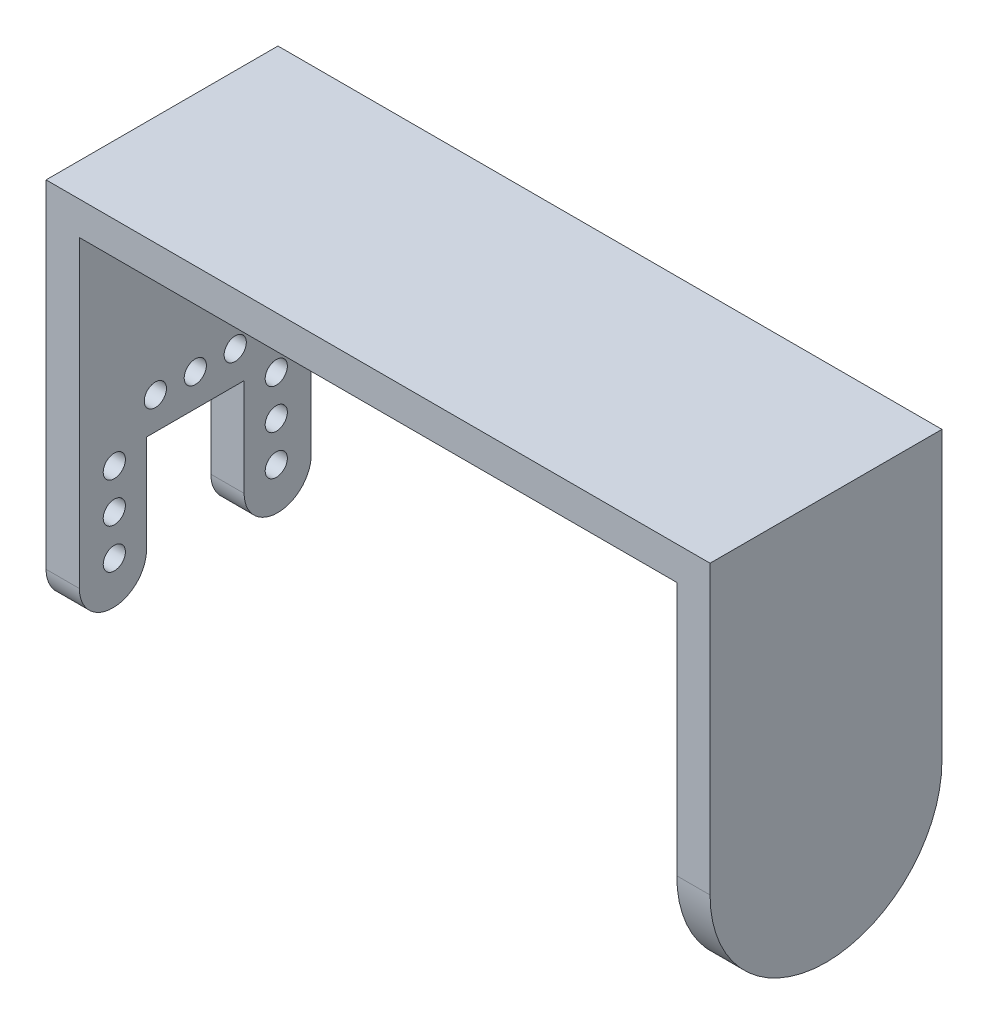
ISO-10303-21;
HEADER;
FILE_DESCRIPTION(('STEP AP214'),'2;1');
FILE_NAME('part.step','',(''),(''),'','','');
FILE_SCHEMA(('AUTOMOTIVE_DESIGN { 1 0 10303 214 1 1 1 1 }'));
ENDSEC;
DATA;
#1=APPLICATION_CONTEXT('core data for automotive mechanical design processes');
#2=APPLICATION_PROTOCOL_DEFINITION('international standard','automotive_design',2000,#1);
#3=PRODUCT_CONTEXT('',#1,'mechanical');
#4=PRODUCT('Part','Part','',(#3));
#5=PRODUCT_RELATED_PRODUCT_CATEGORY('part','',(#4));
#6=PRODUCT_DEFINITION_FORMATION('','',#4);
#7=PRODUCT_DEFINITION_CONTEXT('part definition',#1,'design');
#8=PRODUCT_DEFINITION('design','',#6,#7);
#9=PRODUCT_DEFINITION_SHAPE('','',#8);
#10=(LENGTH_UNIT() NAMED_UNIT(*) SI_UNIT(.MILLI.,.METRE.));
#11=(NAMED_UNIT(*) PLANE_ANGLE_UNIT() SI_UNIT($,.RADIAN.));
#12=(NAMED_UNIT(*) SI_UNIT($,.STERADIAN.) SOLID_ANGLE_UNIT());
#13=UNCERTAINTY_MEASURE_WITH_UNIT(LENGTH_MEASURE(1.E-05),#10,'distance_accuracy_value','');
#14=(GEOMETRIC_REPRESENTATION_CONTEXT(3) GLOBAL_UNCERTAINTY_ASSIGNED_CONTEXT((#13)) GLOBAL_UNIT_ASSIGNED_CONTEXT((#10,
#11,#12)) REPRESENTATION_CONTEXT('',''));
#15=CARTESIAN_POINT('',(0.,0.,0.));
#16=DIRECTION('',(0.,0.,1.));
#17=DIRECTION('',(1.,0.,0.));
#18=AXIS2_PLACEMENT_3D('',#15,#16,#17);
#19=CARTESIAN_POINT('',(0.345806980223205,40.5,67.649975));
#20=DIRECTION('',(1.,0.,0.));
#21=DIRECTION('',(0.,1.,0.));
#22=AXIS2_PLACEMENT_3D('',#19,#20,#21);
#23=PLANE('',#22);
#24=CARTESIAN_POINT('',(0.345806980223204,51.,57.2499750000001));
#25=DIRECTION('',(1.,0.,0.));
#26=DIRECTION('',(0.,1.,0.));
#27=AXIS2_PLACEMENT_3D('',#24,#25,#26);
#28=CIRCLE('',#27,10.5);
#29=CARTESIAN_POINT('',(0.345806980223205,51.,46.7499750000001));
#30=VERTEX_POINT('',#29);
#31=CARTESIAN_POINT('',(0.345806980223206,40.500119048294,57.1999750000001));
#32=VERTEX_POINT('',#31);
#33=EDGE_CURVE('E176',#30,#32,#28,.F.);
#34=ORIENTED_EDGE('',*,*,#33,.T.);
#35=CARTESIAN_POINT('',(0.345806980223204,51.,57.149975));
#36=DIRECTION('',(1.,0.,0.));
#37=DIRECTION('',(0.,1.,0.));
#38=AXIS2_PLACEMENT_3D('',#35,#36,#37);
#39=CIRCLE('',#38,10.5);
#40=CARTESIAN_POINT('',(0.345806980223203,51.,67.649975));
#41=VERTEX_POINT('',#40);
#42=EDGE_CURVE('E135',#32,#41,#39,.F.);
#43=ORIENTED_EDGE('',*,*,#42,.T.);
#44=DIRECTION('',(0.,1.,0.));
#45=VECTOR('',#44,1.);
#46=CARTESIAN_POINT('',(0.345806980223205,40.5,67.649975));
#47=LINE('',#46,#45);
#48=CARTESIAN_POINT('',(0.345806980223197,73.9,67.649975));
#49=VERTEX_POINT('',#48);
#50=EDGE_CURVE('E128',#41,#49,#47,.T.);
#51=ORIENTED_EDGE('',*,*,#50,.T.);
#52=DIRECTION('',(0.,0.,-1.));
#53=VECTOR('',#52,1.);
#54=CARTESIAN_POINT('',(0.345806980223197,73.9,67.649975));
#55=LINE('',#54,#53);
#56=CARTESIAN_POINT('',(0.345806980223198,73.9,46.7499750000001));
#57=VERTEX_POINT('',#56);
#58=EDGE_CURVE('E132',#49,#57,#55,.T.);
#59=ORIENTED_EDGE('',*,*,#58,.T.);
#60=DIRECTION('',(0.,1.,0.));
#61=VECTOR('',#60,1.);
#62=CARTESIAN_POINT('',(0.345806980223208,40.5,46.7499750000001));
#63=LINE('',#62,#61);
#64=EDGE_CURVE('E141',#30,#57,#63,.T.);
#65=ORIENTED_EDGE('',*,*,#64,.F.);
#66=EDGE_LOOP('',(#34,#43,#51,#59,#65));
#67=FACE_BOUND('',#66,.T.);
#68=CARTESIAN_POINT('',(0.345806980223204,50.9,57.199975));
#69=DIRECTION('',(1.,0.,0.));
#70=DIRECTION('',(0.,1.,0.));
#71=AXIS2_PLACEMENT_3D('',#68,#69,#70);
#72=CIRCLE('',#71,2.91);
#73=CARTESIAN_POINT('',(0.345806980223204,53.81,57.199975));
#74=VERTEX_POINT('',#73);
#75=EDGE_CURVE('E186',#74,#74,#72,.F.);
#76=ORIENTED_EDGE('',*,*,#75,.F.);
#77=EDGE_LOOP('',(#76));
#78=FACE_BOUND('',#77,.T.);
#79=ADVANCED_FACE('F34',(#67,#78),#23,.F.);
#80=CARTESIAN_POINT('',(0.,73.9,0.));
#81=DIRECTION('',(0.,1.,0.));
#82=DIRECTION('',(-1.,0.,0.));
#83=AXIS2_PLACEMENT_3D('',#80,#81,#82);
#84=PLANE('',#83);
#85=ORIENTED_EDGE('',*,*,#58,.F.);
#86=DIRECTION('',(1.,0.,0.));
#87=VECTOR('',#86,1.);
#88=CARTESIAN_POINT('',(-56.5041930197768,73.9,67.649975));
#89=LINE('',#88,#87);
#90=CARTESIAN_POINT('',(-53.5041930197768,73.9,67.649975));
#91=VERTEX_POINT('',#90);
#92=EDGE_CURVE('E140',#91,#49,#89,.T.);
#93=ORIENTED_EDGE('',*,*,#92,.F.);
#94=DIRECTION('',(0.,0.,1.));
#95=VECTOR('',#94,1.);
#96=CARTESIAN_POINT('',(-53.5041930197768,73.9,0.));
#97=LINE('',#96,#95);
#98=CARTESIAN_POINT('',(-53.5041930197768,73.9,46.7499750000001));
#99=VERTEX_POINT('',#98);
#100=EDGE_CURVE('E337',#99,#91,#97,.T.);
#101=ORIENTED_EDGE('',*,*,#100,.F.);
#102=DIRECTION('',(-1.,0.,0.));
#103=VECTOR('',#102,1.);
#104=CARTESIAN_POINT('',(-56.5041930197768,73.9,46.7499750000001));
#105=LINE('',#104,#103);
#106=EDGE_CURVE('E147',#57,#99,#105,.T.);
#107=ORIENTED_EDGE('',*,*,#106,.F.);
#108=EDGE_LOOP('',(#85,#93,#101,#107));
#109=FACE_BOUND('',#108,.T.);
#110=ADVANCED_FACE('F144',(#109),#84,.F.);
#111=CARTESIAN_POINT('',(-56.5041930197768,46.5,49.7749750000001));
#112=DIRECTION('',(1.,0.,0.));
#113=DIRECTION('',(0.,1.,0.));
#114=AXIS2_PLACEMENT_3D('',#111,#112,#113);
#115=CYLINDRICAL_SURFACE('',#114,3.02499999999997);
#116=CARTESIAN_POINT('',(-53.5041930197768,46.5,49.7749750000001));
#117=DIRECTION('',(-1.,0.,0.));
#118=DIRECTION('',(0.,0.,1.));
#119=AXIS2_PLACEMENT_3D('',#116,#117,#118);
#120=CIRCLE('',#119,3.02499999999997);
#121=CARTESIAN_POINT('',(-53.5041930197768,46.5,52.7999750000001));
#122=VERTEX_POINT('',#121);
#123=CARTESIAN_POINT('',(-53.5041930197768,46.5,46.7499750000001));
#124=VERTEX_POINT('',#123);
#125=EDGE_CURVE('E309',#122,#124,#120,.F.);
#126=ORIENTED_EDGE('',*,*,#125,.F.);
#127=DIRECTION('',(1.,0.,0.));
#128=VECTOR('',#127,1.);
#129=CARTESIAN_POINT('',(-56.5041930197768,46.5,52.7999750000001));
#130=LINE('',#129,#128);
#131=CARTESIAN_POINT('',(-56.5041930197768,46.5,52.7999750000001));
#132=VERTEX_POINT('',#131);
#133=EDGE_CURVE('E178',#132,#122,#130,.T.);
#134=ORIENTED_EDGE('',*,*,#133,.F.);
#135=CARTESIAN_POINT('',(-56.5041930197768,46.5,49.7749750000001));
#136=DIRECTION('',(-1.,0.,0.));
#137=DIRECTION('',(0.,0.,1.));
#138=AXIS2_PLACEMENT_3D('',#135,#136,#137);
#139=CIRCLE('',#138,3.02499999999997);
#140=CARTESIAN_POINT('',(-56.5041930197768,46.5,46.7499750000001));
#141=VERTEX_POINT('',#140);
#142=EDGE_CURVE('E163',#132,#141,#139,.F.);
#143=ORIENTED_EDGE('',*,*,#142,.T.);
#144=DIRECTION('',(1.,0.,0.));
#145=VECTOR('',#144,1.);
#146=CARTESIAN_POINT('',(-56.5041930197768,46.5,46.7499750000001));
#147=LINE('',#146,#145);
#148=EDGE_CURVE('E371',#141,#124,#147,.T.);
#149=ORIENTED_EDGE('',*,*,#148,.T.);
#150=EDGE_LOOP('',(#126,#134,#143,#149));
#151=FACE_BOUND('',#150,.T.);
#152=ADVANCED_FACE('F208',(#151),#115,.T.);
#153=CARTESIAN_POINT('',(-56.5041930197768,0.,52.7999750000001));
#154=DIRECTION('',(0.,0.,-1.));
#155=DIRECTION('',(-1.,0.,0.));
#156=AXIS2_PLACEMENT_3D('',#153,#154,#155);
#157=PLANE('',#156);
#158=DIRECTION('',(0.,1.,0.));
#159=VECTOR('',#158,1.);
#160=CARTESIAN_POINT('',(-53.5041930197768,0.,52.7999750000001));
#161=LINE('',#160,#159);
#162=CARTESIAN_POINT('',(-53.5041930197768,55.3,52.7999750000001));
#163=VERTEX_POINT('',#162);
#164=EDGE_CURVE('E312',#122,#163,#161,.T.);
#165=ORIENTED_EDGE('',*,*,#164,.T.);
#166=DIRECTION('',(1.,0.,0.));
#167=VECTOR('',#166,1.);
#168=CARTESIAN_POINT('',(-56.5041930197768,55.3,52.7999750000001));
#169=LINE('',#168,#167);
#170=CARTESIAN_POINT('',(-56.5041930197768,55.3,52.7999750000001));
#171=VERTEX_POINT('',#170);
#172=EDGE_CURVE('E379',#171,#163,#169,.T.);
#173=ORIENTED_EDGE('',*,*,#172,.F.);
#174=DIRECTION('',(0.,1.,0.));
#175=VECTOR('',#174,1.);
#176=CARTESIAN_POINT('',(-56.5041930197768,0.,52.7999750000001));
#177=LINE('',#176,#175);
#178=EDGE_CURVE('E383',#132,#171,#177,.T.);
#179=ORIENTED_EDGE('',*,*,#178,.F.);
#180=ORIENTED_EDGE('',*,*,#133,.T.);
#181=EDGE_LOOP('',(#165,#173,#179,#180));
#182=FACE_BOUND('',#181,.T.);
#183=ADVANCED_FACE('F281',(#182),#157,.F.);
#184=CARTESIAN_POINT('',(-56.5041930197768,55.3,0.));
#185=DIRECTION('',(0.,-1.,0.));
#186=DIRECTION('',(1.,0.,0.));
#187=AXIS2_PLACEMENT_3D('',#184,#185,#186);
#188=PLANE('',#187);
#189=DIRECTION('',(0.,0.,-1.));
#190=VECTOR('',#189,1.);
#191=CARTESIAN_POINT('',(-53.5041930197768,55.3,0.));
#192=LINE('',#191,#190);
#193=CARTESIAN_POINT('',(-53.5041930197768,55.3,61.5999750000001));
#194=VERTEX_POINT('',#193);
#195=EDGE_CURVE('E319',#194,#163,#192,.T.);
#196=ORIENTED_EDGE('',*,*,#195,.F.);
#197=DIRECTION('',(1.,0.,0.));
#198=VECTOR('',#197,1.);
#199=CARTESIAN_POINT('',(-56.5041930197768,55.3,61.5999750000001));
#200=LINE('',#199,#198);
#201=CARTESIAN_POINT('',(-56.5041930197768,55.3,61.5999750000001));
#202=VERTEX_POINT('',#201);
#203=EDGE_CURVE('E377',#202,#194,#200,.T.);
#204=ORIENTED_EDGE('',*,*,#203,.F.);
#205=DIRECTION('',(0.,0.,-1.));
#206=VECTOR('',#205,1.);
#207=CARTESIAN_POINT('',(-56.5041930197768,55.3,0.));
#208=LINE('',#207,#206);
#209=EDGE_CURVE('E399',#202,#171,#208,.T.);
#210=ORIENTED_EDGE('',*,*,#209,.T.);
#211=ORIENTED_EDGE('',*,*,#172,.T.);
#212=EDGE_LOOP('',(#196,#204,#210,#211));
#213=FACE_BOUND('',#212,.T.);
#214=ADVANCED_FACE('F277',(#213),#188,.T.);
#215=CARTESIAN_POINT('',(-56.5041930197768,0.,61.5999750000001));
#216=DIRECTION('',(0.,0.,-1.));
#217=DIRECTION('',(-1.,0.,0.));
#218=AXIS2_PLACEMENT_3D('',#215,#216,#217);
#219=PLANE('',#218);
#220=DIRECTION('',(0.,1.,0.));
#221=VECTOR('',#220,1.);
#222=CARTESIAN_POINT('',(-53.5041930197768,0.,61.5999750000001));
#223=LINE('',#222,#221);
#224=CARTESIAN_POINT('',(-53.5041930197768,46.5,61.5999750000001));
#225=VERTEX_POINT('',#224);
#226=EDGE_CURVE('E327',#225,#194,#223,.T.);
#227=ORIENTED_EDGE('',*,*,#226,.F.);
#228=DIRECTION('',(1.,0.,0.));
#229=VECTOR('',#228,1.);
#230=CARTESIAN_POINT('',(-56.5041930197768,46.5,61.5999750000001));
#231=LINE('',#230,#229);
#232=CARTESIAN_POINT('',(-56.5041930197768,46.5,61.5999750000001));
#233=VERTEX_POINT('',#232);
#234=EDGE_CURVE('E375',#233,#225,#231,.T.);
#235=ORIENTED_EDGE('',*,*,#234,.F.);
#236=DIRECTION('',(0.,1.,0.));
#237=VECTOR('',#236,1.);
#238=CARTESIAN_POINT('',(-56.5041930197768,0.,61.5999750000001));
#239=LINE('',#238,#237);
#240=EDGE_CURVE('E396',#233,#202,#239,.T.);
#241=ORIENTED_EDGE('',*,*,#240,.T.);
#242=ORIENTED_EDGE('',*,*,#203,.T.);
#243=EDGE_LOOP('',(#227,#235,#241,#242));
#244=FACE_BOUND('',#243,.T.);
#245=ADVANCED_FACE('F273',(#244),#219,.T.);
#246=CARTESIAN_POINT('',(-56.5041930197768,46.5,64.624975));
#247=DIRECTION('',(1.,0.,0.));
#248=DIRECTION('',(0.,1.,0.));
#249=AXIS2_PLACEMENT_3D('',#246,#247,#248);
#250=CYLINDRICAL_SURFACE('',#249,3.02499999999999);
#251=CARTESIAN_POINT('',(-53.5041930197768,46.5,64.624975));
#252=DIRECTION('',(-1.,0.,0.));
#253=DIRECTION('',(0.,0.,1.));
#254=AXIS2_PLACEMENT_3D('',#251,#252,#253);
#255=CIRCLE('',#254,3.02499999999999);
#256=CARTESIAN_POINT('',(-53.5041930197768,46.5,67.649975));
#257=VERTEX_POINT('',#256);
#258=EDGE_CURVE('E330',#225,#257,#255,.T.);
#259=ORIENTED_EDGE('',*,*,#258,.T.);
#260=DIRECTION('',(1.,0.,0.));
#261=VECTOR('',#260,1.);
#262=CARTESIAN_POINT('',(-56.5041930197768,46.5,67.649975));
#263=LINE('',#262,#261);
#264=CARTESIAN_POINT('',(-56.5041930197768,46.5,67.649975));
#265=VERTEX_POINT('',#264);
#266=EDGE_CURVE('E373',#265,#257,#263,.T.);
#267=ORIENTED_EDGE('',*,*,#266,.F.);
#268=CARTESIAN_POINT('',(-56.5041930197768,46.5,64.624975));
#269=DIRECTION('',(-1.,0.,0.));
#270=DIRECTION('',(0.,0.,1.));
#271=AXIS2_PLACEMENT_3D('',#268,#269,#270);
#272=CIRCLE('',#271,3.02499999999999);
#273=EDGE_CURVE('E401',#233,#265,#272,.T.);
#274=ORIENTED_EDGE('',*,*,#273,.F.);
#275=ORIENTED_EDGE('',*,*,#234,.T.);
#276=EDGE_LOOP('',(#259,#267,#274,#275));
#277=FACE_BOUND('',#276,.T.);
#278=ADVANCED_FACE('F270',(#277),#250,.T.);
#279=CARTESIAN_POINT('',(-56.5041930197768,0.,67.649975));
#280=DIRECTION('',(0.,0.,-1.));
#281=DIRECTION('',(-1.,0.,0.));
#282=AXIS2_PLACEMENT_3D('',#279,#280,#281);
#283=PLANE('',#282);
#284=ORIENTED_EDGE('',*,*,#50,.F.);
#285=DIRECTION('',(-1.,0.,0.));
#286=VECTOR('',#285,1.);
#287=CARTESIAN_POINT('',(-56.5041930197768,51.,67.649975));
#288=LINE('',#287,#286);
#289=CARTESIAN_POINT('',(3.3458069802232,51.,67.649975));
#290=VERTEX_POINT('',#289);
#291=EDGE_CURVE('E180',#41,#290,#288,.F.);
#292=ORIENTED_EDGE('',*,*,#291,.T.);
#293=DIRECTION('',(0.,-1.,0.));
#294=VECTOR('',#293,1.);
#295=CARTESIAN_POINT('',(3.3458069802232,76.9,67.649975));
#296=LINE('',#295,#294);
#297=CARTESIAN_POINT('',(3.3458069802232,76.9,67.649975));
#298=VERTEX_POINT('',#297);
#299=EDGE_CURVE('E161',#298,#290,#296,.T.);
#300=ORIENTED_EDGE('',*,*,#299,.F.);
#301=DIRECTION('',(1.,0.,0.));
#302=VECTOR('',#301,1.);
#303=CARTESIAN_POINT('',(-56.5041930197768,76.9,67.649975));
#304=LINE('',#303,#302);
#305=CARTESIAN_POINT('',(-56.5041930197768,76.9,67.649975));
#306=VERTEX_POINT('',#305);
#307=EDGE_CURVE('E304',#306,#298,#304,.T.);
#308=ORIENTED_EDGE('',*,*,#307,.F.);
#309=DIRECTION('',(0.,1.,0.));
#310=VECTOR('',#309,1.);
#311=CARTESIAN_POINT('',(-56.5041930197768,0.,67.649975));
#312=LINE('',#311,#310);
#313=EDGE_CURVE('E405',#265,#306,#312,.T.);
#314=ORIENTED_EDGE('',*,*,#313,.F.);
#315=ORIENTED_EDGE('',*,*,#266,.T.);
#316=DIRECTION('',(0.,1.,0.));
#317=VECTOR('',#316,1.);
#318=CARTESIAN_POINT('',(-53.5041930197768,0.,67.649975));
#319=LINE('',#318,#317);
#320=EDGE_CURVE('E153',#257,#91,#319,.T.);
#321=ORIENTED_EDGE('',*,*,#320,.T.);
#322=ORIENTED_EDGE('',*,*,#92,.T.);
#323=EDGE_LOOP('',(#284,#292,#300,#308,#314,#315,#321,#322));
#324=FACE_BOUND('',#323,.T.);
#325=ADVANCED_FACE('F150',(#324),#283,.F.);
#326=CARTESIAN_POINT('',(-56.5041930197768,50.8999999999998,49.8999749999999));
#327=DIRECTION('',(1.,0.,0.));
#328=DIRECTION('',(0.,1.,0.));
#329=AXIS2_PLACEMENT_3D('',#326,#327,#328);
#330=CYLINDRICAL_SURFACE('',#329,1.);
#331=CARTESIAN_POINT('',(-56.5041930197768,50.8999999999998,49.8999749999999));
#332=DIRECTION('',(-1.,0.,0.));
#333=DIRECTION('',(0.,0.,1.));
#334=AXIS2_PLACEMENT_3D('',#331,#332,#333);
#335=CIRCLE('',#334,1.);
#336=CARTESIAN_POINT('',(-56.5041930197768,50.8999999999998,50.8999749999999));
#337=VERTEX_POINT('',#336);
#338=EDGE_CURVE('E428',#337,#337,#335,.F.);
#339=ORIENTED_EDGE('',*,*,#338,.F.);
#340=EDGE_LOOP('',(#339));
#341=FACE_BOUND('',#340,.T.);
#342=CARTESIAN_POINT('',(-53.5041930197768,50.8999999999998,49.8999749999999));
#343=DIRECTION('',(-1.,0.,0.));
#344=DIRECTION('',(0.,0.,1.));
#345=AXIS2_PLACEMENT_3D('',#342,#343,#344);
#346=CIRCLE('',#345,1.);
#347=CARTESIAN_POINT('',(-53.5041930197768,50.8999999999998,50.8999749999999));
#348=VERTEX_POINT('',#347);
#349=EDGE_CURVE('E365',#348,#348,#346,.F.);
#350=ORIENTED_EDGE('',*,*,#349,.T.);
#351=EDGE_LOOP('',(#350));
#352=FACE_BOUND('',#351,.T.);
#353=ADVANCED_FACE('F233',(#341,#352),#330,.F.);
#354=CARTESIAN_POINT('',(-56.5041930197768,58.2,60.7999749999998));
#355=DIRECTION('',(1.,0.,0.));
#356=DIRECTION('',(0.,1.,0.));
#357=AXIS2_PLACEMENT_3D('',#354,#355,#356);
#358=CYLINDRICAL_SURFACE('',#357,0.999999999999997);
#359=CARTESIAN_POINT('',(-56.5041930197768,58.2,60.7999749999998));
#360=DIRECTION('',(-1.,0.,0.));
#361=DIRECTION('',(0.,0.,1.));
#362=AXIS2_PLACEMENT_3D('',#359,#360,#361);
#363=CIRCLE('',#362,0.999999999999997);
#364=CARTESIAN_POINT('',(-56.5041930197768,58.2,61.7999749999998));
#365=VERTEX_POINT('',#364);
#366=EDGE_CURVE('E426',#365,#365,#363,.F.);
#367=ORIENTED_EDGE('',*,*,#366,.F.);
#368=EDGE_LOOP('',(#367));
#369=FACE_BOUND('',#368,.T.);
#370=CARTESIAN_POINT('',(-53.5041930197768,58.2,60.7999749999998));
#371=DIRECTION('',(-1.,0.,0.));
#372=DIRECTION('',(0.,0.,1.));
#373=AXIS2_PLACEMENT_3D('',#370,#371,#372);
#374=CIRCLE('',#373,0.999999999999997);
#375=CARTESIAN_POINT('',(-53.5041930197768,58.2,61.7999749999998));
#376=VERTEX_POINT('',#375);
#377=EDGE_CURVE('E362',#376,#376,#374,.F.);
#378=ORIENTED_EDGE('',*,*,#377,.T.);
#379=EDGE_LOOP('',(#378));
#380=FACE_BOUND('',#379,.T.);
#381=ADVANCED_FACE('F236',(#369,#380),#358,.F.);
#382=CARTESIAN_POINT('',(-56.5041930197768,54.5000000000001,64.4999749999999));
#383=DIRECTION('',(1.,0.,0.));
#384=DIRECTION('',(0.,1.,0.));
#385=AXIS2_PLACEMENT_3D('',#382,#383,#384);
#386=CYLINDRICAL_SURFACE('',#385,0.999999999999999);
#387=CARTESIAN_POINT('',(-56.5041930197768,54.5000000000001,64.4999749999999));
#388=DIRECTION('',(-1.,0.,0.));
#389=DIRECTION('',(0.,0.,1.));
#390=AXIS2_PLACEMENT_3D('',#387,#388,#389);
#391=CIRCLE('',#390,0.999999999999999);
#392=CARTESIAN_POINT('',(-56.5041930197768,54.5000000000001,65.4999749999999));
#393=VERTEX_POINT('',#392);
#394=EDGE_CURVE('E423',#393,#393,#391,.F.);
#395=ORIENTED_EDGE('',*,*,#394,.F.);
#396=EDGE_LOOP('',(#395));
#397=FACE_BOUND('',#396,.T.);
#398=CARTESIAN_POINT('',(-53.5041930197768,54.5000000000001,64.4999749999999));
#399=DIRECTION('',(-1.,0.,0.));
#400=DIRECTION('',(0.,0.,1.));
#401=AXIS2_PLACEMENT_3D('',#398,#399,#400);
#402=CIRCLE('',#401,0.999999999999999);
#403=CARTESIAN_POINT('',(-53.5041930197768,54.5000000000001,65.4999749999999));
#404=VERTEX_POINT('',#403);
#405=EDGE_CURVE('E359',#404,#404,#402,.F.);
#406=ORIENTED_EDGE('',*,*,#405,.T.);
#407=EDGE_LOOP('',(#406));
#408=FACE_BOUND('',#407,.T.);
#409=ADVANCED_FACE('F240',(#397,#408),#386,.F.);
#410=CARTESIAN_POINT('',(-56.5041930197768,50.9000000000001,64.4999749999999));
#411=DIRECTION('',(1.,0.,0.));
#412=DIRECTION('',(0.,1.,0.));
#413=AXIS2_PLACEMENT_3D('',#410,#411,#412);
#414=CYLINDRICAL_SURFACE('',#413,1.);
#415=CARTESIAN_POINT('',(-56.5041930197768,50.9000000000001,64.4999749999999));
#416=DIRECTION('',(-1.,0.,0.));
#417=DIRECTION('',(0.,0.,1.));
#418=AXIS2_PLACEMENT_3D('',#415,#416,#417);
#419=CIRCLE('',#418,1.);
#420=CARTESIAN_POINT('',(-56.5041930197768,50.9000000000001,65.4999749999999));
#421=VERTEX_POINT('',#420);
#422=EDGE_CURVE('E420',#421,#421,#419,.F.);
#423=ORIENTED_EDGE('',*,*,#422,.F.);
#424=EDGE_LOOP('',(#423));
#425=FACE_BOUND('',#424,.T.);
#426=CARTESIAN_POINT('',(-53.5041930197768,50.9000000000001,64.4999749999999));
#427=DIRECTION('',(-1.,0.,0.));
#428=DIRECTION('',(0.,0.,1.));
#429=AXIS2_PLACEMENT_3D('',#426,#427,#428);
#430=CIRCLE('',#429,1.);
#431=CARTESIAN_POINT('',(-53.5041930197768,50.9000000000001,65.4999749999999));
#432=VERTEX_POINT('',#431);
#433=EDGE_CURVE('E356',#432,#432,#430,.F.);
#434=ORIENTED_EDGE('',*,*,#433,.T.);
#435=EDGE_LOOP('',(#434));
#436=FACE_BOUND('',#435,.T.);
#437=ADVANCED_FACE('F244',(#425,#436),#414,.F.);
#438=CARTESIAN_POINT('',(-56.5041930197768,47.3000000000001,64.4999749999999));
#439=DIRECTION('',(1.,0.,0.));
#440=DIRECTION('',(0.,1.,0.));
#441=AXIS2_PLACEMENT_3D('',#438,#439,#440);
#442=CYLINDRICAL_SURFACE('',#441,0.999999999999999);
#443=CARTESIAN_POINT('',(-56.5041930197768,47.3000000000001,64.4999749999999));
#444=DIRECTION('',(-1.,0.,0.));
#445=DIRECTION('',(0.,0.,1.));
#446=AXIS2_PLACEMENT_3D('',#443,#444,#445);
#447=CIRCLE('',#446,0.999999999999999);
#448=CARTESIAN_POINT('',(-56.5041930197768,47.3000000000001,65.4999749999999));
#449=VERTEX_POINT('',#448);
#450=EDGE_CURVE('E417',#449,#449,#447,.F.);
#451=ORIENTED_EDGE('',*,*,#450,.F.);
#452=EDGE_LOOP('',(#451));
#453=FACE_BOUND('',#452,.T.);
#454=CARTESIAN_POINT('',(-53.5041930197768,47.3000000000001,64.4999749999999));
#455=DIRECTION('',(-1.,0.,0.));
#456=DIRECTION('',(0.,0.,1.));
#457=AXIS2_PLACEMENT_3D('',#454,#455,#456);
#458=CIRCLE('',#457,0.999999999999999);
#459=CARTESIAN_POINT('',(-53.5041930197768,47.3000000000001,65.4999749999999));
#460=VERTEX_POINT('',#459);
#461=EDGE_CURVE('E351',#460,#460,#458,.F.);
#462=ORIENTED_EDGE('',*,*,#461,.T.);
#463=EDGE_LOOP('',(#462));
#464=FACE_BOUND('',#463,.T.);
#465=ADVANCED_FACE('F248',(#453,#464),#442,.F.);
#466=CARTESIAN_POINT('',(-56.5041930197768,58.2,57.1999749999998));
#467=DIRECTION('',(1.,0.,0.));
#468=DIRECTION('',(0.,1.,0.));
#469=AXIS2_PLACEMENT_3D('',#466,#467,#468);
#470=CYLINDRICAL_SURFACE('',#469,0.999999999999998);
#471=CARTESIAN_POINT('',(-56.5041930197768,58.2,57.1999749999998));
#472=DIRECTION('',(-1.,0.,0.));
#473=DIRECTION('',(0.,0.,1.));
#474=AXIS2_PLACEMENT_3D('',#471,#472,#473);
#475=CIRCLE('',#474,0.999999999999998);
#476=CARTESIAN_POINT('',(-56.5041930197768,58.2,58.1999749999998));
#477=VERTEX_POINT('',#476);
#478=EDGE_CURVE('E414',#477,#477,#475,.F.);
#479=ORIENTED_EDGE('',*,*,#478,.F.);
#480=EDGE_LOOP('',(#479));
#481=FACE_BOUND('',#480,.T.);
#482=CARTESIAN_POINT('',(-53.5041930197768,58.2,57.1999749999998));
#483=DIRECTION('',(-1.,0.,0.));
#484=DIRECTION('',(0.,0.,1.));
#485=AXIS2_PLACEMENT_3D('',#482,#483,#484);
#486=CIRCLE('',#485,0.999999999999998);
#487=CARTESIAN_POINT('',(-53.5041930197768,58.2,58.1999749999998));
#488=VERTEX_POINT('',#487);
#489=EDGE_CURVE('E347',#488,#488,#486,.F.);
#490=ORIENTED_EDGE('',*,*,#489,.T.);
#491=EDGE_LOOP('',(#490));
#492=FACE_BOUND('',#491,.T.);
#493=ADVANCED_FACE('F252',(#481,#492),#470,.F.);
#494=CARTESIAN_POINT('',(-56.5041930197768,58.1999999999999,53.5999749999998));
#495=DIRECTION('',(1.,0.,0.));
#496=DIRECTION('',(0.,1.,0.));
#497=AXIS2_PLACEMENT_3D('',#494,#495,#496);
#498=CYLINDRICAL_SURFACE('',#497,1.);
#499=CARTESIAN_POINT('',(-56.5041930197768,58.1999999999999,53.5999749999998));
#500=DIRECTION('',(-1.,0.,0.));
#501=DIRECTION('',(0.,0.,1.));
#502=AXIS2_PLACEMENT_3D('',#499,#500,#501);
#503=CIRCLE('',#502,1.);
#504=CARTESIAN_POINT('',(-56.5041930197768,58.1999999999999,54.5999749999998));
#505=VERTEX_POINT('',#504);
#506=EDGE_CURVE('E411',#505,#505,#503,.F.);
#507=ORIENTED_EDGE('',*,*,#506,.F.);
#508=EDGE_LOOP('',(#507));
#509=FACE_BOUND('',#508,.T.);
#510=CARTESIAN_POINT('',(-53.5041930197768,58.1999999999999,53.5999749999998));
#511=DIRECTION('',(-1.,0.,0.));
#512=DIRECTION('',(0.,0.,1.));
#513=AXIS2_PLACEMENT_3D('',#510,#511,#512);
#514=CIRCLE('',#513,1.);
#515=CARTESIAN_POINT('',(-53.5041930197768,58.1999999999999,54.5999749999998));
#516=VERTEX_POINT('',#515);
#517=EDGE_CURVE('E343',#516,#516,#514,.F.);
#518=ORIENTED_EDGE('',*,*,#517,.T.);
#519=EDGE_LOOP('',(#518));
#520=FACE_BOUND('',#519,.T.);
#521=ADVANCED_FACE('F256',(#509,#520),#498,.F.);
#522=CARTESIAN_POINT('',(-56.5041930197768,54.4999999999998,49.8999749999999));
#523=DIRECTION('',(1.,0.,0.));
#524=DIRECTION('',(0.,1.,0.));
#525=AXIS2_PLACEMENT_3D('',#522,#523,#524);
#526=CYLINDRICAL_SURFACE('',#525,0.999999999999998);
#527=CARTESIAN_POINT('',(-56.5041930197768,54.4999999999998,49.8999749999999));
#528=DIRECTION('',(-1.,0.,0.));
#529=DIRECTION('',(0.,0.,1.));
#530=AXIS2_PLACEMENT_3D('',#527,#528,#529);
#531=CIRCLE('',#530,0.999999999999998);
#532=CARTESIAN_POINT('',(-56.5041930197768,54.4999999999998,50.8999749999999));
#533=VERTEX_POINT('',#532);
#534=EDGE_CURVE('E408',#533,#533,#531,.F.);
#535=ORIENTED_EDGE('',*,*,#534,.F.);
#536=EDGE_LOOP('',(#535));
#537=FACE_BOUND('',#536,.T.);
#538=CARTESIAN_POINT('',(-53.5041930197768,54.4999999999998,49.8999749999999));
#539=DIRECTION('',(-1.,0.,0.));
#540=DIRECTION('',(0.,0.,1.));
#541=AXIS2_PLACEMENT_3D('',#538,#539,#540);
#542=CIRCLE('',#541,0.999999999999998);
#543=CARTESIAN_POINT('',(-53.5041930197768,54.4999999999998,50.8999749999999));
#544=VERTEX_POINT('',#543);
#545=EDGE_CURVE('E334',#544,#544,#542,.F.);
#546=ORIENTED_EDGE('',*,*,#545,.T.);
#547=EDGE_LOOP('',(#546));
#548=FACE_BOUND('',#547,.T.);
#549=ADVANCED_FACE('F260',(#537,#548),#526,.F.);
#550=CARTESIAN_POINT('',(-56.5041930197768,0.,46.7499750000001));
#551=DIRECTION('',(0.,0.,-1.));
#552=DIRECTION('',(-1.,0.,0.));
#553=AXIS2_PLACEMENT_3D('',#550,#551,#552);
#554=PLANE('',#553);
#555=DIRECTION('',(0.,-1.,0.));
#556=VECTOR('',#555,1.);
#557=CARTESIAN_POINT('',(3.3458069802232,76.9,46.7499750000001));
#558=LINE('',#557,#556);
#559=CARTESIAN_POINT('',(3.3458069802232,76.9,46.7499750000001));
#560=VERTEX_POINT('',#559);
#561=CARTESIAN_POINT('',(3.3458069802232,51.,46.7499750000001));
#562=VERTEX_POINT('',#561);
#563=EDGE_CURVE('E171',#560,#562,#558,.T.);
#564=ORIENTED_EDGE('',*,*,#563,.T.);
#565=DIRECTION('',(1.,0.,0.));
#566=VECTOR('',#565,1.);
#567=CARTESIAN_POINT('',(0.345806980223208,51.,46.7499750000001));
#568=LINE('',#567,#566);
#569=EDGE_CURVE('E184',#562,#30,#568,.F.);
#570=ORIENTED_EDGE('',*,*,#569,.T.);
#571=ORIENTED_EDGE('',*,*,#64,.T.);
#572=ORIENTED_EDGE('',*,*,#106,.T.);
#573=DIRECTION('',(0.,1.,0.));
#574=VECTOR('',#573,1.);
#575=CARTESIAN_POINT('',(-53.5041930197768,0.,46.7499750000001));
#576=LINE('',#575,#574);
#577=EDGE_CURVE('E339',#124,#99,#576,.T.);
#578=ORIENTED_EDGE('',*,*,#577,.F.);
#579=ORIENTED_EDGE('',*,*,#148,.F.);
#580=DIRECTION('',(0.,1.,0.));
#581=VECTOR('',#580,1.);
#582=CARTESIAN_POINT('',(-56.5041930197768,0.,46.7499750000001));
#583=LINE('',#582,#581);
#584=CARTESIAN_POINT('',(-56.5041930197768,76.9,46.7499750000001));
#585=VERTEX_POINT('',#584);
#586=EDGE_CURVE('E389',#141,#585,#583,.T.);
#587=ORIENTED_EDGE('',*,*,#586,.T.);
#588=DIRECTION('',(-1.,0.,0.));
#589=VECTOR('',#588,1.);
#590=CARTESIAN_POINT('',(-56.5041930197768,76.9,46.7499750000001));
#591=LINE('',#590,#589);
#592=EDGE_CURVE('E168',#560,#585,#591,.T.);
#593=ORIENTED_EDGE('',*,*,#592,.F.);
#594=EDGE_LOOP('',(#564,#570,#571,#572,#578,#579,#587,#593));
#595=FACE_BOUND('',#594,.T.);
#596=ADVANCED_FACE('F231',(#595),#554,.T.);
#597=CARTESIAN_POINT('',(-56.5041930197768,47.2999999999998,49.899975));
#598=DIRECTION('',(1.,0.,0.));
#599=DIRECTION('',(0.,1.,0.));
#600=AXIS2_PLACEMENT_3D('',#597,#598,#599);
#601=CYLINDRICAL_SURFACE('',#600,1.);
#602=CARTESIAN_POINT('',(-56.5041930197768,47.2999999999998,49.899975));
#603=DIRECTION('',(-1.,0.,0.));
#604=DIRECTION('',(0.,0.,1.));
#605=AXIS2_PLACEMENT_3D('',#602,#603,#604);
#606=CIRCLE('',#605,1.);
#607=CARTESIAN_POINT('',(-56.5041930197768,47.2999999999998,50.899975));
#608=VERTEX_POINT('',#607);
#609=EDGE_CURVE('E322',#608,#608,#606,.F.);
#610=ORIENTED_EDGE('',*,*,#609,.F.);
#611=EDGE_LOOP('',(#610));
#612=FACE_BOUND('',#611,.T.);
#613=CARTESIAN_POINT('',(-53.5041930197768,47.2999999999998,49.899975));
#614=DIRECTION('',(-1.,0.,0.));
#615=DIRECTION('',(0.,0.,1.));
#616=AXIS2_PLACEMENT_3D('',#613,#614,#615);
#617=CIRCLE('',#616,1.);
#618=CARTESIAN_POINT('',(-53.5041930197768,47.2999999999998,50.899975));
#619=VERTEX_POINT('',#618);
#620=EDGE_CURVE('E368',#619,#619,#617,.F.);
#621=ORIENTED_EDGE('',*,*,#620,.T.);
#622=EDGE_LOOP('',(#621));
#623=FACE_BOUND('',#622,.T.);
#624=ADVANCED_FACE('F224',(#612,#623),#601,.F.);
#625=CARTESIAN_POINT('',(-56.5041930197768,0.,0.));
#626=DIRECTION('',(-1.,0.,0.));
#627=DIRECTION('',(0.,0.,1.));
#628=AXIS2_PLACEMENT_3D('',#625,#626,#627);
#629=PLANE('',#628);
#630=ORIENTED_EDGE('',*,*,#142,.F.);
#631=ORIENTED_EDGE('',*,*,#178,.T.);
#632=ORIENTED_EDGE('',*,*,#209,.F.);
#633=ORIENTED_EDGE('',*,*,#240,.F.);
#634=ORIENTED_EDGE('',*,*,#273,.T.);
#635=ORIENTED_EDGE('',*,*,#313,.T.);
#636=DIRECTION('',(0.,0.,1.));
#637=VECTOR('',#636,1.);
#638=CARTESIAN_POINT('',(-56.5041930197768,76.9,46.7499750000001));
#639=LINE('',#638,#637);
#640=EDGE_CURVE('E156',#585,#306,#639,.T.);
#641=ORIENTED_EDGE('',*,*,#640,.F.);
#642=ORIENTED_EDGE('',*,*,#586,.F.);
#643=EDGE_LOOP('',(#630,#631,#632,#633,#634,#635,#641,#642));
#644=FACE_BOUND('',#643,.T.);
#645=ORIENTED_EDGE('',*,*,#534,.T.);
#646=EDGE_LOOP('',(#645));
#647=FACE_BOUND('',#646,.T.);
#648=ORIENTED_EDGE('',*,*,#506,.T.);
#649=EDGE_LOOP('',(#648));
#650=FACE_BOUND('',#649,.T.);
#651=ORIENTED_EDGE('',*,*,#478,.T.);
#652=EDGE_LOOP('',(#651));
#653=FACE_BOUND('',#652,.T.);
#654=ORIENTED_EDGE('',*,*,#450,.T.);
#655=EDGE_LOOP('',(#654));
#656=FACE_BOUND('',#655,.T.);
#657=ORIENTED_EDGE('',*,*,#422,.T.);
#658=EDGE_LOOP('',(#657));
#659=FACE_BOUND('',#658,.T.);
#660=ORIENTED_EDGE('',*,*,#394,.T.);
#661=EDGE_LOOP('',(#660));
#662=FACE_BOUND('',#661,.T.);
#663=ORIENTED_EDGE('',*,*,#366,.T.);
#664=EDGE_LOOP('',(#663));
#665=FACE_BOUND('',#664,.T.);
#666=ORIENTED_EDGE('',*,*,#338,.T.);
#667=EDGE_LOOP('',(#666));
#668=FACE_BOUND('',#667,.T.);
#669=ORIENTED_EDGE('',*,*,#609,.T.);
#670=EDGE_LOOP('',(#669));
#671=FACE_BOUND('',#670,.T.);
#672=ADVANCED_FACE('F221',(#644,#647,#650,#653,#656,#659,#662,#665,#668,#671),#629,.T.);
#673=CARTESIAN_POINT('',(-53.5041930197768,0.,0.));
#674=DIRECTION('',(-1.,0.,0.));
#675=DIRECTION('',(0.,0.,1.));
#676=AXIS2_PLACEMENT_3D('',#673,#674,#675);
#677=PLANE('',#676);
#678=ORIENTED_EDGE('',*,*,#125,.T.);
#679=ORIENTED_EDGE('',*,*,#577,.T.);
#680=ORIENTED_EDGE('',*,*,#100,.T.);
#681=ORIENTED_EDGE('',*,*,#320,.F.);
#682=ORIENTED_EDGE('',*,*,#258,.F.);
#683=ORIENTED_EDGE('',*,*,#226,.T.);
#684=ORIENTED_EDGE('',*,*,#195,.T.);
#685=ORIENTED_EDGE('',*,*,#164,.F.);
#686=EDGE_LOOP('',(#678,#679,#680,#681,#682,#683,#684,#685));
#687=FACE_BOUND('',#686,.T.);
#688=ORIENTED_EDGE('',*,*,#545,.F.);
#689=EDGE_LOOP('',(#688));
#690=FACE_BOUND('',#689,.T.);
#691=ORIENTED_EDGE('',*,*,#517,.F.);
#692=EDGE_LOOP('',(#691));
#693=FACE_BOUND('',#692,.T.);
#694=ORIENTED_EDGE('',*,*,#489,.F.);
#695=EDGE_LOOP('',(#694));
#696=FACE_BOUND('',#695,.T.);
#697=ORIENTED_EDGE('',*,*,#461,.F.);
#698=EDGE_LOOP('',(#697));
#699=FACE_BOUND('',#698,.T.);
#700=ORIENTED_EDGE('',*,*,#433,.F.);
#701=EDGE_LOOP('',(#700));
#702=FACE_BOUND('',#701,.T.);
#703=ORIENTED_EDGE('',*,*,#405,.F.);
#704=EDGE_LOOP('',(#703));
#705=FACE_BOUND('',#704,.T.);
#706=ORIENTED_EDGE('',*,*,#377,.F.);
#707=EDGE_LOOP('',(#706));
#708=FACE_BOUND('',#707,.T.);
#709=ORIENTED_EDGE('',*,*,#349,.F.);
#710=EDGE_LOOP('',(#709));
#711=FACE_BOUND('',#710,.T.);
#712=ORIENTED_EDGE('',*,*,#620,.F.);
#713=EDGE_LOOP('',(#712));
#714=FACE_BOUND('',#713,.T.);
#715=ADVANCED_FACE('F220',(#687,#690,#693,#696,#699,#702,#705,#708,#711,#714),#677,.F.);
#716=CARTESIAN_POINT('',(3.3458069802232,76.9,46.7499750000001));
#717=DIRECTION('',(-1.,0.,0.));
#718=DIRECTION('',(0.,-1.,0.));
#719=AXIS2_PLACEMENT_3D('',#716,#717,#718);
#720=PLANE('',#719);
#721=ORIENTED_EDGE('',*,*,#299,.T.);
#722=CARTESIAN_POINT('',(3.3458069802232,51.,57.149975));
#723=DIRECTION('',(-1.,0.,0.));
#724=DIRECTION('',(0.,-1.,0.));
#725=AXIS2_PLACEMENT_3D('',#722,#723,#724);
#726=CIRCLE('',#725,10.5);
#727=CARTESIAN_POINT('',(3.3458069802232,40.500119048294,57.1999750000001));
#728=VERTEX_POINT('',#727);
#729=EDGE_CURVE('E49',#290,#728,#726,.F.);
#730=ORIENTED_EDGE('',*,*,#729,.T.);
#731=CARTESIAN_POINT('',(3.3458069802232,51.,57.2499750000001));
#732=DIRECTION('',(-1.,0.,0.));
#733=DIRECTION('',(0.,-1.,0.));
#734=AXIS2_PLACEMENT_3D('',#731,#732,#733);
#735=CIRCLE('',#734,10.5);
#736=EDGE_CURVE('E53',#728,#562,#735,.F.);
#737=ORIENTED_EDGE('',*,*,#736,.T.);
#738=ORIENTED_EDGE('',*,*,#563,.F.);
#739=DIRECTION('',(0.,0.,-1.));
#740=VECTOR('',#739,1.);
#741=CARTESIAN_POINT('',(3.3458069802232,76.9,46.7499750000001));
#742=LINE('',#741,#740);
#743=EDGE_CURVE('E305',#298,#560,#742,.T.);
#744=ORIENTED_EDGE('',*,*,#743,.F.);
#745=EDGE_LOOP('',(#721,#730,#737,#738,#744));
#746=FACE_BOUND('',#745,.T.);
#747=ADVANCED_FACE('F215',(#746),#720,.F.);
#748=CARTESIAN_POINT('',(0.,76.9,0.));
#749=DIRECTION('',(0.,1.,0.));
#750=DIRECTION('',(-1.,0.,0.));
#751=AXIS2_PLACEMENT_3D('',#748,#749,#750);
#752=PLANE('',#751);
#753=ORIENTED_EDGE('',*,*,#640,.T.);
#754=ORIENTED_EDGE('',*,*,#307,.T.);
#755=ORIENTED_EDGE('',*,*,#743,.T.);
#756=ORIENTED_EDGE('',*,*,#592,.T.);
#757=EDGE_LOOP('',(#753,#754,#755,#756));
#758=FACE_BOUND('',#757,.T.);
#759=ADVANCED_FACE('F212',(#758),#752,.T.);
#760=CARTESIAN_POINT('',(0.,51.,57.2499750000001));
#761=DIRECTION('',(-1.,0.,0.));
#762=DIRECTION('',(0.,0.,1.));
#763=AXIS2_PLACEMENT_3D('',#760,#761,#762);
#764=CYLINDRICAL_SURFACE('',#763,10.5);
#765=ORIENTED_EDGE('',*,*,#569,.F.);
#766=ORIENTED_EDGE('',*,*,#736,.F.);
#767=DIRECTION('',(-1.,0.,0.));
#768=VECTOR('',#767,1.);
#769=CARTESIAN_POINT('',(1.84580698022321,40.500119048294,57.1999750000001));
#770=LINE('',#769,#768);
#771=EDGE_CURVE('E148',#32,#728,#770,.F.);
#772=ORIENTED_EDGE('',*,*,#771,.F.);
#773=ORIENTED_EDGE('',*,*,#33,.F.);
#774=EDGE_LOOP('',(#765,#766,#772,#773));
#775=FACE_BOUND('',#774,.T.);
#776=ADVANCED_FACE('F214',(#775),#764,.T.);
#777=CARTESIAN_POINT('',(0.,51.,57.149975));
#778=DIRECTION('',(-1.,0.,0.));
#779=DIRECTION('',(0.,0.,1.));
#780=AXIS2_PLACEMENT_3D('',#777,#778,#779);
#781=CYLINDRICAL_SURFACE('',#780,10.5);
#782=ORIENTED_EDGE('',*,*,#729,.F.);
#783=ORIENTED_EDGE('',*,*,#291,.F.);
#784=ORIENTED_EDGE('',*,*,#42,.F.);
#785=ORIENTED_EDGE('',*,*,#771,.T.);
#786=EDGE_LOOP('',(#782,#783,#784,#785));
#787=FACE_BOUND('',#786,.T.);
#788=ADVANCED_FACE('F289',(#787),#781,.T.);
#789=CARTESIAN_POINT('',(-5.6541930197768,50.9,57.199975));
#790=DIRECTION('',(1.,0.,0.));
#791=DIRECTION('',(0.,1.,0.));
#792=AXIS2_PLACEMENT_3D('',#789,#790,#791);
#793=CYLINDRICAL_SURFACE('',#792,2.91);
#794=CARTESIAN_POINT('',(-3.6541930197768,50.9,57.199975));
#795=DIRECTION('',(-1.,0.,0.));
#796=DIRECTION('',(0.,-1.,0.));
#797=AXIS2_PLACEMENT_3D('',#794,#795,#796);
#798=CIRCLE('',#797,2.91);
#799=CARTESIAN_POINT('',(-3.6541930197768,53.81,57.199975));
#800=VERTEX_POINT('',#799);
#801=EDGE_CURVE('E11',#800,#800,#798,.F.);
#802=CARTESIAN_POINT('',(-3.6541930197768,53.81,57.199975));
#803=CARTESIAN_POINT('',(-3.61252635311014,53.81,57.199975));
#804=CARTESIAN_POINT('',(-3.57085968644347,53.81,57.199975));
#805=CARTESIAN_POINT('',(-3.48752635311014,53.81,57.199975));
#806=CARTESIAN_POINT('',(-3.44585968644347,53.81,57.199975));
#807=CARTESIAN_POINT('',(-3.36252635311014,53.81,57.199975));
#808=CARTESIAN_POINT('',(-3.32085968644347,53.81,57.199975));
#809=CARTESIAN_POINT('',(-3.23752635311014,53.81,57.199975));
#810=CARTESIAN_POINT('',(-3.19585968644347,53.81,57.199975));
#811=CARTESIAN_POINT('',(-3.11252635311014,53.81,57.199975));
#812=CARTESIAN_POINT('',(-3.07085968644347,53.81,57.199975));
#813=CARTESIAN_POINT('',(-2.98752635311014,53.81,57.199975));
#814=CARTESIAN_POINT('',(-2.94585968644347,53.81,57.199975));
#815=CARTESIAN_POINT('',(-2.86252635311013,53.81,57.199975));
#816=CARTESIAN_POINT('',(-2.82085968644347,53.81,57.199975));
#817=CARTESIAN_POINT('',(-2.73752635311013,53.81,57.199975));
#818=CARTESIAN_POINT('',(-2.69585968644347,53.81,57.199975));
#819=CARTESIAN_POINT('',(-2.61252635311013,53.81,57.199975));
#820=CARTESIAN_POINT('',(-2.57085968644347,53.81,57.199975));
#821=CARTESIAN_POINT('',(-2.48752635311013,53.81,57.199975));
#822=CARTESIAN_POINT('',(-2.44585968644347,53.81,57.199975));
#823=CARTESIAN_POINT('',(-2.36252635311013,53.81,57.199975));
#824=CARTESIAN_POINT('',(-2.32085968644347,53.81,57.199975));
#825=CARTESIAN_POINT('',(-2.23752635311013,53.81,57.199975));
#826=CARTESIAN_POINT('',(-2.19585968644347,53.81,57.199975));
#827=CARTESIAN_POINT('',(-2.11252635311013,53.81,57.199975));
#828=CARTESIAN_POINT('',(-2.07085968644347,53.81,57.199975));
#829=CARTESIAN_POINT('',(-1.98752635311013,53.81,57.199975));
#830=CARTESIAN_POINT('',(-1.94585968644347,53.81,57.199975));
#831=CARTESIAN_POINT('',(-1.86252635311013,53.81,57.199975));
#832=CARTESIAN_POINT('',(-1.82085968644347,53.81,57.199975));
#833=CARTESIAN_POINT('',(-1.73752635311013,53.81,57.199975));
#834=CARTESIAN_POINT('',(-1.69585968644347,53.81,57.199975));
#835=CARTESIAN_POINT('',(-1.61252635311013,53.81,57.199975));
#836=CARTESIAN_POINT('',(-1.57085968644347,53.81,57.199975));
#837=CARTESIAN_POINT('',(-1.48752635311013,53.81,57.199975));
#838=CARTESIAN_POINT('',(-1.44585968644347,53.81,57.199975));
#839=CARTESIAN_POINT('',(-1.36252635311013,53.81,57.199975));
#840=CARTESIAN_POINT('',(-1.32085968644347,53.81,57.199975));
#841=CARTESIAN_POINT('',(-1.23752635311013,53.81,57.199975));
#842=CARTESIAN_POINT('',(-1.19585968644347,53.81,57.199975));
#843=CARTESIAN_POINT('',(-1.11252635311013,53.81,57.199975));
#844=CARTESIAN_POINT('',(-1.07085968644347,53.81,57.199975));
#845=CARTESIAN_POINT('',(-0.987526353110132,53.81,57.199975));
#846=CARTESIAN_POINT('',(-0.945859686443465,53.81,57.199975));
#847=CARTESIAN_POINT('',(-0.862526353110132,53.81,57.199975));
#848=CARTESIAN_POINT('',(-0.820859686443465,53.81,57.199975));
#849=CARTESIAN_POINT('',(-0.737526353110132,53.81,57.199975));
#850=CARTESIAN_POINT('',(-0.695859686443465,53.81,57.199975));
#851=CARTESIAN_POINT('',(-0.612526353110131,53.81,57.199975));
#852=CARTESIAN_POINT('',(-0.570859686443465,53.81,57.199975));
#853=CARTESIAN_POINT('',(-0.487526353110131,53.81,57.199975));
#854=CARTESIAN_POINT('',(-0.445859686443465,53.81,57.199975));
#855=CARTESIAN_POINT('',(-0.362526353110131,53.81,57.199975));
#856=CARTESIAN_POINT('',(-0.320859686443464,53.81,57.199975));
#857=CARTESIAN_POINT('',(-0.23752635311013,53.81,57.199975));
#858=CARTESIAN_POINT('',(-0.195859686443464,53.81,57.199975));
#859=CARTESIAN_POINT('',(-0.11252635311013,53.81,57.199975));
#860=CARTESIAN_POINT('',(-0.0708596864434635,53.81,57.199975));
#861=CARTESIAN_POINT('',(0.0124736468898699,53.81,57.199975));
#862=CARTESIAN_POINT('',(0.0541403135565366,53.81,57.199975));
#863=CARTESIAN_POINT('',(0.13747364688987,53.81,57.199975));
#864=CARTESIAN_POINT('',(0.179140313556537,53.81,57.199975));
#865=CARTESIAN_POINT('',(0.26247364688987,53.81,57.199975));
#866=CARTESIAN_POINT('',(0.304140313556537,53.81,57.199975));
#867=CARTESIAN_POINT('',(0.345806980223204,53.81,57.199975));
#868=B_SPLINE_CURVE_WITH_KNOTS('',3,(#802,#803,#804,#805,#806,#807,#808,#809,#810,#811,#812,
#813,#814,#815,#816,#817,#818,#819,#820,#821,#822,#823,#824,#825,#826,#827,#828,#829,#830,#831,
#832,#833,#834,#835,#836,#837,#838,#839,#840,#841,#842,#843,#844,#845,#846,#847,#848,#849,#850,
#851,#852,#853,#854,#855,#856,#857,#858,#859,#860,#861,#862,#863,#864,#865,#866,#867),
.UNSPECIFIED.,.F.,.F.,(4,2,2,2,2,2,2,2,2,2,2,2,2,2,2,2,2,2,2,2,2,2,2,2,2,2,2,2,2,2,2,2,4),(0.,
0.125,0.25,0.375000000000001,0.500000000000001,0.625000000000001,0.750000000000002,
0.875000000000002,1.,1.125,1.25,1.375,1.5,1.625,1.75,1.875,2.,2.125,2.25,2.375,2.5,2.625,2.75,
2.875,3.,3.125,3.25,3.37500000000001,3.50000000000001,3.62500000000001,3.75000000000001,
3.87500000000001,4.00000000000001),.UNSPECIFIED.);
#869=EDGE_CURVE('BSEAM200',#800,#74,#868,.T.);
#870=ORIENTED_EDGE('',*,*,#801,.T.);
#871=ORIENTED_EDGE('',*,*,#75,.T.);
#872=ORIENTED_EDGE('',*,*,#869,.T.);
#873=ORIENTED_EDGE('',*,*,#869,.F.);
#874=EDGE_LOOP('',(#870,#872,#871,#873));
#875=FACE_BOUND('',#874,.T.);
#876=ADVANCED_FACE('F200',(#875),#793,.T.);
#877=CARTESIAN_POINT('',(-5.6541930197768,50.9,57.199975));
#878=DIRECTION('',(-1.,0.,0.));
#879=DIRECTION('',(0.,-1.,0.));
#880=AXIS2_PLACEMENT_3D('',#877,#878,#879);
#881=PLANE('',#880);
#882=CARTESIAN_POINT('',(-5.6541930197768,50.9,57.199975));
#883=DIRECTION('',(-1.,0.,0.));
#884=DIRECTION('',(0.,-1.,0.));
#885=AXIS2_PLACEMENT_3D('',#882,#883,#884);
#886=CIRCLE('',#885,0.909999999999997);
#887=CARTESIAN_POINT('',(-5.6541930197768,49.99,57.199975));
#888=VERTEX_POINT('',#887);
#889=EDGE_CURVE('E42',#888,#888,#886,.T.);
#890=ORIENTED_EDGE('',*,*,#889,.T.);
#891=EDGE_LOOP('',(#890));
#892=FACE_BOUND('',#891,.T.);
#893=ADVANCED_FACE('F193',(#892),#881,.T.);
#894=CARTESIAN_POINT('',(-3.6541930197768,50.9,57.199975));
#895=DIRECTION('',(-1.,0.,0.));
#896=DIRECTION('',(0.,-1.,0.));
#897=AXIS2_PLACEMENT_3D('',#894,#895,#896);
#898=DEGENERATE_TOROIDAL_SURFACE('',#897,0.909999999999997,2.,.T.);
#899=ORIENTED_EDGE('',*,*,#801,.F.);
#900=EDGE_LOOP('',(#899));
#901=FACE_BOUND('',#900,.T.);
#902=ORIENTED_EDGE('',*,*,#889,.F.);
#903=EDGE_LOOP('',(#902));
#904=FACE_BOUND('',#903,.T.);
#905=ADVANCED_FACE('F36',(#901,#904),#898,.T.);
#906=CLOSED_SHELL('',(#79,#110,#152,#183,#214,#245,#278,#325,#353,#381,#409,#437,#465,#493,#521,
#549,#596,#624,#672,#715,#747,#759,#776,#788,#876,#893,#905));
#907=MANIFOLD_SOLID_BREP('B2',#906);
#908=ADVANCED_BREP_SHAPE_REPRESENTATION('',(#18,#907),#14);
#909=SHAPE_DEFINITION_REPRESENTATION(#9,#908);
ENDSEC;
END-ISO-10303-21;
